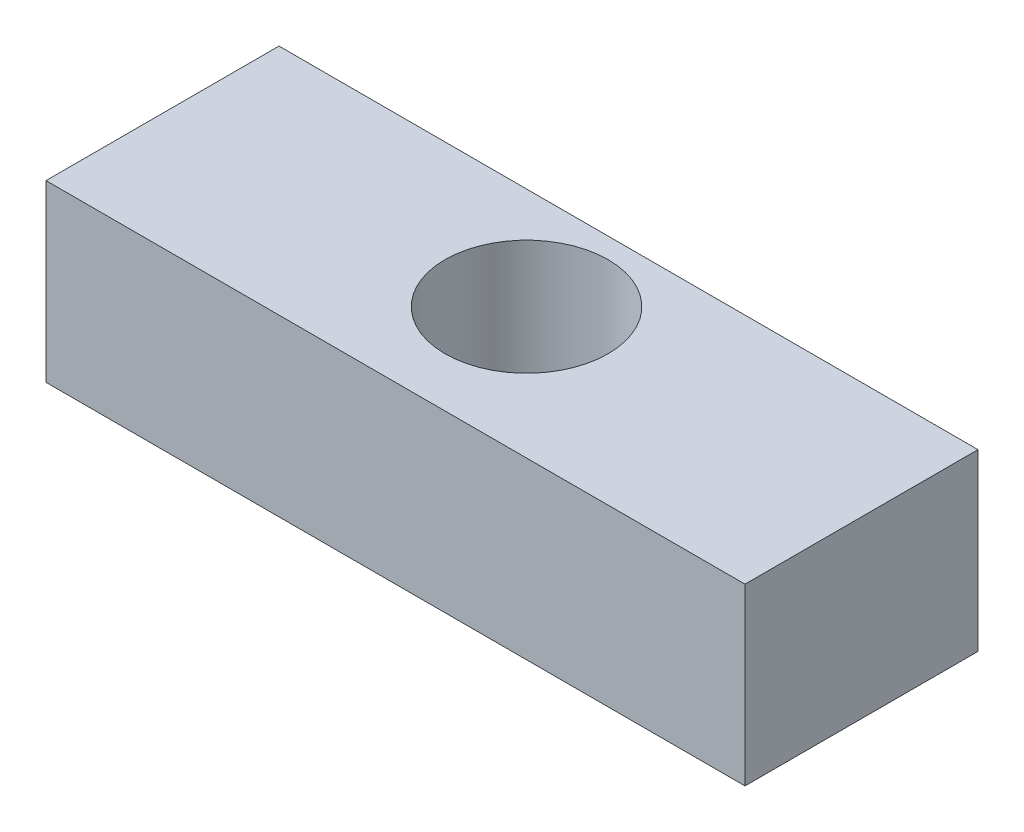
ISO-10303-21;
HEADER;
FILE_DESCRIPTION(('STEP AP214'),'2;1');
FILE_NAME('part.step','',(''),(''),'','','');
FILE_SCHEMA(('AUTOMOTIVE_DESIGN { 1 0 10303 214 1 1 1 1 }'));
ENDSEC;
DATA;
#1=APPLICATION_CONTEXT('core data for automotive mechanical design processes');
#2=APPLICATION_PROTOCOL_DEFINITION('international standard','automotive_design',2000,#1);
#3=PRODUCT_CONTEXT('',#1,'mechanical');
#4=PRODUCT('Part','Part','',(#3));
#5=PRODUCT_RELATED_PRODUCT_CATEGORY('part','',(#4));
#6=PRODUCT_DEFINITION_FORMATION('','',#4);
#7=PRODUCT_DEFINITION_CONTEXT('part definition',#1,'design');
#8=PRODUCT_DEFINITION('design','',#6,#7);
#9=PRODUCT_DEFINITION_SHAPE('','',#8);
#10=(LENGTH_UNIT() NAMED_UNIT(*) SI_UNIT(.MILLI.,.METRE.));
#11=(NAMED_UNIT(*) PLANE_ANGLE_UNIT() SI_UNIT($,.RADIAN.));
#12=(NAMED_UNIT(*) SI_UNIT($,.STERADIAN.) SOLID_ANGLE_UNIT());
#13=UNCERTAINTY_MEASURE_WITH_UNIT(LENGTH_MEASURE(1.E-05),#10,'distance_accuracy_value','');
#14=(GEOMETRIC_REPRESENTATION_CONTEXT(3) GLOBAL_UNCERTAINTY_ASSIGNED_CONTEXT((#13)) GLOBAL_UNIT_ASSIGNED_CONTEXT((#10,
#11,#12)) REPRESENTATION_CONTEXT('',''));
#15=CARTESIAN_POINT('',(0.,0.,0.));
#16=DIRECTION('',(0.,0.,1.));
#17=DIRECTION('',(1.,0.,0.));
#18=AXIS2_PLACEMENT_3D('',#15,#16,#17);
#19=CARTESIAN_POINT('',(0.,9.525,0.));
#20=DIRECTION('',(0.,-1.,0.));
#21=DIRECTION('',(0.,0.,-1.));
#22=AXIS2_PLACEMENT_3D('',#19,#20,#21);
#23=PLANE('',#22);
#24=DIRECTION('',(0.,0.,1.));
#25=VECTOR('',#24,1.);
#26=CARTESIAN_POINT('',(0.,9.525,0.));
#27=LINE('',#26,#25);
#28=CARTESIAN_POINT('',(0.,9.525,-12.7));
#29=VERTEX_POINT('',#28);
#30=CARTESIAN_POINT('',(0.,9.525,0.));
#31=VERTEX_POINT('',#30);
#32=EDGE_CURVE('E85',#29,#31,#27,.T.);
#33=ORIENTED_EDGE('',*,*,#32,.T.);
#34=DIRECTION('',(1.,0.,0.));
#35=VECTOR('',#34,1.);
#36=CARTESIAN_POINT('',(0.,9.525,0.));
#37=LINE('',#36,#35);
#38=CARTESIAN_POINT('',(38.1,9.525,0.));
#39=VERTEX_POINT('',#38);
#40=EDGE_CURVE('E80',#31,#39,#37,.T.);
#41=ORIENTED_EDGE('',*,*,#40,.T.);
#42=DIRECTION('',(0.,0.,-1.));
#43=VECTOR('',#42,1.);
#44=CARTESIAN_POINT('',(38.1,9.525,0.));
#45=LINE('',#44,#43);
#46=CARTESIAN_POINT('',(38.1,9.525,-12.7));
#47=VERTEX_POINT('',#46);
#48=EDGE_CURVE('E83',#39,#47,#45,.T.);
#49=ORIENTED_EDGE('',*,*,#48,.T.);
#50=DIRECTION('',(-1.,0.,0.));
#51=VECTOR('',#50,1.);
#52=CARTESIAN_POINT('',(0.,9.525,-12.7));
#53=LINE('',#52,#51);
#54=EDGE_CURVE('E50',#47,#29,#53,.T.);
#55=ORIENTED_EDGE('',*,*,#54,.T.);
#56=EDGE_LOOP('',(#33,#41,#49,#55));
#57=FACE_BOUND('',#56,.T.);
#58=CARTESIAN_POINT('',(19.05,9.525,-7.14375));
#59=DIRECTION('',(0.,1.,0.));
#60=DIRECTION('',(0.,0.,1.));
#61=AXIS2_PLACEMENT_3D('',#58,#59,#60);
#62=CIRCLE('',#61,4.445);
#63=CARTESIAN_POINT('',(19.05,9.525,-2.69875));
#64=VERTEX_POINT('',#63);
#65=EDGE_CURVE('E100',#64,#64,#62,.T.);
#66=ORIENTED_EDGE('',*,*,#65,.F.);
#67=EDGE_LOOP('',(#66));
#68=FACE_BOUND('',#67,.T.);
#69=ADVANCED_FACE('F33',(#57,#68),#23,.F.);
#70=CARTESIAN_POINT('',(0.,0.,0.));
#71=DIRECTION('',(0.,-1.,0.));
#72=DIRECTION('',(0.,0.,-1.));
#73=AXIS2_PLACEMENT_3D('',#70,#71,#72);
#74=PLANE('',#73);
#75=DIRECTION('',(0.,0.,1.));
#76=VECTOR('',#75,1.);
#77=CARTESIAN_POINT('',(0.,0.,0.));
#78=LINE('',#77,#76);
#79=CARTESIAN_POINT('',(0.,0.,-12.7));
#80=VERTEX_POINT('',#79);
#81=CARTESIAN_POINT('',(0.,0.,0.));
#82=VERTEX_POINT('',#81);
#83=EDGE_CURVE('E97',#80,#82,#78,.T.);
#84=ORIENTED_EDGE('',*,*,#83,.F.);
#85=DIRECTION('',(-1.,0.,0.));
#86=VECTOR('',#85,1.);
#87=CARTESIAN_POINT('',(0.,0.,-12.7));
#88=LINE('',#87,#86);
#89=CARTESIAN_POINT('',(38.1,0.,-12.7));
#90=VERTEX_POINT('',#89);
#91=EDGE_CURVE('E73',#90,#80,#88,.T.);
#92=ORIENTED_EDGE('',*,*,#91,.F.);
#93=DIRECTION('',(0.,0.,-1.));
#94=VECTOR('',#93,1.);
#95=CARTESIAN_POINT('',(38.1,0.,0.));
#96=LINE('',#95,#94);
#97=CARTESIAN_POINT('',(38.1,0.,0.));
#98=VERTEX_POINT('',#97);
#99=EDGE_CURVE('E67',#98,#90,#96,.T.);
#100=ORIENTED_EDGE('',*,*,#99,.F.);
#101=DIRECTION('',(1.,0.,0.));
#102=VECTOR('',#101,1.);
#103=CARTESIAN_POINT('',(0.,0.,0.));
#104=LINE('',#103,#102);
#105=EDGE_CURVE('E89',#82,#98,#104,.T.);
#106=ORIENTED_EDGE('',*,*,#105,.F.);
#107=EDGE_LOOP('',(#84,#92,#100,#106));
#108=FACE_BOUND('',#107,.T.);
#109=CARTESIAN_POINT('',(19.05,0.,-7.14375));
#110=DIRECTION('',(0.,1.,0.));
#111=DIRECTION('',(0.,0.,1.));
#112=AXIS2_PLACEMENT_3D('',#109,#110,#111);
#113=CIRCLE('',#112,4.445);
#114=CARTESIAN_POINT('',(19.05,0.,-2.69875));
#115=VERTEX_POINT('',#114);
#116=EDGE_CURVE('E112',#115,#115,#113,.T.);
#117=ORIENTED_EDGE('',*,*,#116,.T.);
#118=EDGE_LOOP('',(#117));
#119=FACE_BOUND('',#118,.T.);
#120=ADVANCED_FACE('F108',(#108,#119),#74,.T.);
#121=CARTESIAN_POINT('',(0.,9.525,0.));
#122=DIRECTION('',(1.,0.,0.));
#123=DIRECTION('',(0.,0.,-1.));
#124=AXIS2_PLACEMENT_3D('',#121,#122,#123);
#125=PLANE('',#124);
#126=ORIENTED_EDGE('',*,*,#83,.T.);
#127=DIRECTION('',(0.,-1.,0.));
#128=VECTOR('',#127,1.);
#129=CARTESIAN_POINT('',(0.,9.525,0.));
#130=LINE('',#129,#128);
#131=EDGE_CURVE('E11',#31,#82,#130,.T.);
#132=ORIENTED_EDGE('',*,*,#131,.F.);
#133=ORIENTED_EDGE('',*,*,#32,.F.);
#134=DIRECTION('',(0.,-1.,0.));
#135=VECTOR('',#134,1.);
#136=CARTESIAN_POINT('',(0.,9.525,-12.7));
#137=LINE('',#136,#135);
#138=EDGE_CURVE('E93',#29,#80,#137,.T.);
#139=ORIENTED_EDGE('',*,*,#138,.T.);
#140=EDGE_LOOP('',(#126,#132,#133,#139));
#141=FACE_BOUND('',#140,.T.);
#142=ADVANCED_FACE('F35',(#141),#125,.F.);
#143=CARTESIAN_POINT('',(0.,9.525,0.));
#144=DIRECTION('',(0.,0.,-1.));
#145=DIRECTION('',(-1.,0.,0.));
#146=AXIS2_PLACEMENT_3D('',#143,#144,#145);
#147=PLANE('',#146);
#148=ORIENTED_EDGE('',*,*,#105,.T.);
#149=DIRECTION('',(0.,-1.,0.));
#150=VECTOR('',#149,1.);
#151=CARTESIAN_POINT('',(38.1,9.525,0.));
#152=LINE('',#151,#150);
#153=EDGE_CURVE('E42',#39,#98,#152,.T.);
#154=ORIENTED_EDGE('',*,*,#153,.F.);
#155=ORIENTED_EDGE('',*,*,#40,.F.);
#156=ORIENTED_EDGE('',*,*,#131,.T.);
#157=EDGE_LOOP('',(#148,#154,#155,#156));
#158=FACE_BOUND('',#157,.T.);
#159=ADVANCED_FACE('F88',(#158),#147,.F.);
#160=CARTESIAN_POINT('',(38.1,9.525,0.));
#161=DIRECTION('',(-1.,0.,0.));
#162=DIRECTION('',(0.,0.,1.));
#163=AXIS2_PLACEMENT_3D('',#160,#161,#162);
#164=PLANE('',#163);
#165=ORIENTED_EDGE('',*,*,#99,.T.);
#166=DIRECTION('',(0.,-1.,0.));
#167=VECTOR('',#166,1.);
#168=CARTESIAN_POINT('',(38.1,9.525,-12.7));
#169=LINE('',#168,#167);
#170=EDGE_CURVE('E90',#47,#90,#169,.T.);
#171=ORIENTED_EDGE('',*,*,#170,.F.);
#172=ORIENTED_EDGE('',*,*,#48,.F.);
#173=ORIENTED_EDGE('',*,*,#153,.T.);
#174=EDGE_LOOP('',(#165,#171,#172,#173));
#175=FACE_BOUND('',#174,.T.);
#176=ADVANCED_FACE('F91',(#175),#164,.F.);
#177=CARTESIAN_POINT('',(0.,9.525,-12.7));
#178=DIRECTION('',(0.,0.,1.));
#179=DIRECTION('',(1.,0.,0.));
#180=AXIS2_PLACEMENT_3D('',#177,#178,#179);
#181=PLANE('',#180);
#182=ORIENTED_EDGE('',*,*,#91,.T.);
#183=ORIENTED_EDGE('',*,*,#138,.F.);
#184=ORIENTED_EDGE('',*,*,#54,.F.);
#185=ORIENTED_EDGE('',*,*,#170,.T.);
#186=EDGE_LOOP('',(#182,#183,#184,#185));
#187=FACE_BOUND('',#186,.T.);
#188=ADVANCED_FACE('F105',(#187),#181,.F.);
#189=CARTESIAN_POINT('',(19.05,9.525,-7.14375));
#190=DIRECTION('',(0.,-1.,0.));
#191=DIRECTION('',(0.,0.,-1.));
#192=AXIS2_PLACEMENT_3D('',#189,#190,#191);
#193=CYLINDRICAL_SURFACE('',#192,4.445);
#194=ORIENTED_EDGE('',*,*,#65,.T.);
#195=EDGE_LOOP('',(#194));
#196=FACE_BOUND('',#195,.T.);
#197=ORIENTED_EDGE('',*,*,#116,.F.);
#198=EDGE_LOOP('',(#197));
#199=FACE_BOUND('',#198,.T.);
#200=ADVANCED_FACE('F118',(#196,#199),#193,.F.);
#201=CLOSED_SHELL('',(#69,#120,#142,#159,#176,#188,#200));
#202=MANIFOLD_SOLID_BREP('B2',#201);
#203=ADVANCED_BREP_SHAPE_REPRESENTATION('',(#18,#202),#14);
#204=SHAPE_DEFINITION_REPRESENTATION(#9,#203);
ENDSEC;
END-ISO-10303-21;
